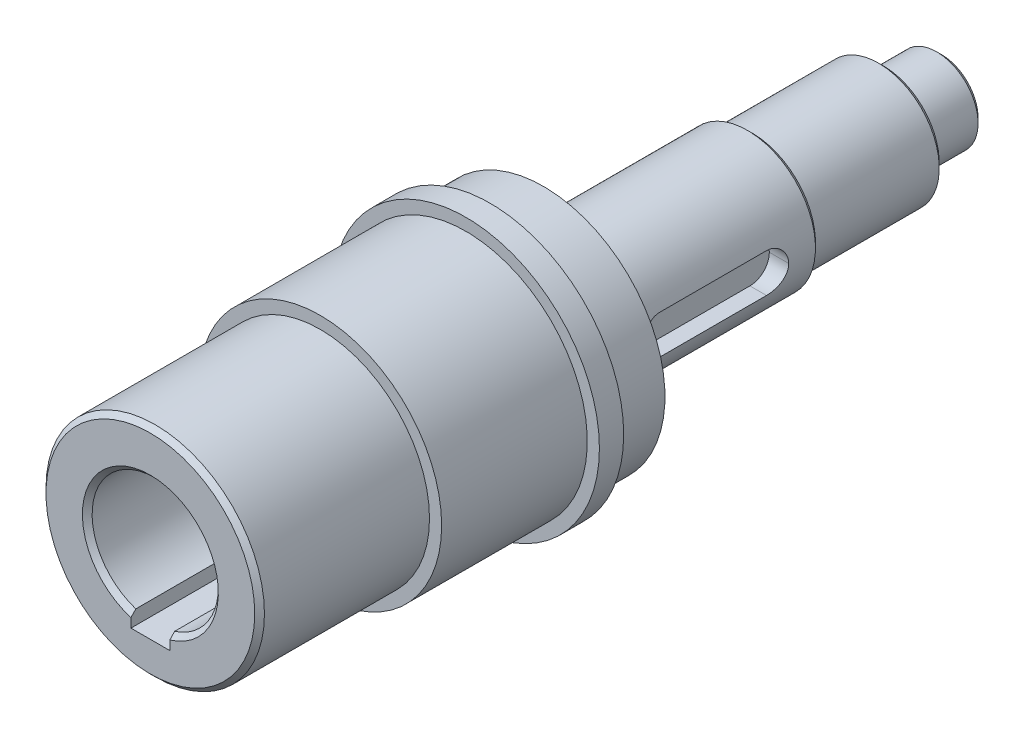
ISO-10303-21;
HEADER;
FILE_DESCRIPTION(('STEP AP214'),'2;1');
FILE_NAME('part.step','',(''),(''),'','','');
FILE_SCHEMA(('AUTOMOTIVE_DESIGN { 1 0 10303 214 1 1 1 1 }'));
ENDSEC;
DATA;
#1=APPLICATION_CONTEXT('core data for automotive mechanical design processes');
#2=APPLICATION_PROTOCOL_DEFINITION('international standard','automotive_design',2000,#1);
#3=PRODUCT_CONTEXT('',#1,'mechanical');
#4=PRODUCT('Part','Part','',(#3));
#5=PRODUCT_RELATED_PRODUCT_CATEGORY('part','',(#4));
#6=PRODUCT_DEFINITION_FORMATION('','',#4);
#7=PRODUCT_DEFINITION_CONTEXT('part definition',#1,'design');
#8=PRODUCT_DEFINITION('design','',#6,#7);
#9=PRODUCT_DEFINITION_SHAPE('','',#8);
#10=(LENGTH_UNIT() NAMED_UNIT(*) SI_UNIT(.MILLI.,.METRE.));
#11=(NAMED_UNIT(*) PLANE_ANGLE_UNIT() SI_UNIT($,.RADIAN.));
#12=(NAMED_UNIT(*) SI_UNIT($,.STERADIAN.) SOLID_ANGLE_UNIT());
#13=UNCERTAINTY_MEASURE_WITH_UNIT(LENGTH_MEASURE(1.E-05),#10,'distance_accuracy_value','');
#14=(GEOMETRIC_REPRESENTATION_CONTEXT(3) GLOBAL_UNCERTAINTY_ASSIGNED_CONTEXT((#13)) GLOBAL_UNIT_ASSIGNED_CONTEXT((#10,
#11,#12)) REPRESENTATION_CONTEXT('',''));
#15=CARTESIAN_POINT('',(0.,0.,0.));
#16=DIRECTION('',(0.,0.,1.));
#17=DIRECTION('',(1.,0.,0.));
#18=AXIS2_PLACEMENT_3D('',#15,#16,#17);
#19=CARTESIAN_POINT('',(0.,0.,30.));
#20=DIRECTION('',(0.,0.,1.));
#21=DIRECTION('',(1.,0.,0.));
#22=AXIS2_PLACEMENT_3D('',#19,#20,#21);
#23=PLANE('',#22);
#24=CARTESIAN_POINT('',(0.,0.,30.));
#25=DIRECTION('',(0.,0.,1.));
#26=DIRECTION('',(1.,0.,0.));
#27=AXIS2_PLACEMENT_3D('',#24,#25,#26);
#28=CIRCLE('',#27,25.);
#29=CARTESIAN_POINT('',(25.,0.,30.));
#30=VERTEX_POINT('',#29);
#31=EDGE_CURVE('E188',#30,#30,#28,.T.);
#32=ORIENTED_EDGE('',*,*,#31,.T.);
#33=EDGE_LOOP('',(#32));
#34=FACE_BOUND('',#33,.T.);
#35=CARTESIAN_POINT('',(0.,0.,30.));
#36=DIRECTION('',(0.,0.,1.));
#37=DIRECTION('',(1.,0.,0.));
#38=AXIS2_PLACEMENT_3D('',#35,#36,#37);
#39=CIRCLE('',#38,22.5);
#40=CARTESIAN_POINT('',(22.5,0.,30.));
#41=VERTEX_POINT('',#40);
#42=EDGE_CURVE('E153',#41,#41,#39,.T.);
#43=ORIENTED_EDGE('',*,*,#42,.F.);
#44=EDGE_LOOP('',(#43));
#45=FACE_BOUND('',#44,.T.);
#46=ADVANCED_FACE('F32',(#34,#45),#23,.T.);
#47=CARTESIAN_POINT('',(0.,0.,-59.));
#48=DIRECTION('',(0.,0.,1.));
#49=DIRECTION('',(1.,0.,0.));
#50=AXIS2_PLACEMENT_3D('',#47,#48,#49);
#51=CYLINDRICAL_SURFACE('',#50,14.);
#52=CARTESIAN_POINT('',(0.,0.,-58.));
#53=DIRECTION('',(0.,0.,-1.));
#54=DIRECTION('',(-1.,0.,0.));
#55=AXIS2_PLACEMENT_3D('',#52,#53,#54);
#56=CIRCLE('',#55,14.);
#57=CARTESIAN_POINT('',(-14.,0.,-58.));
#58=VERTEX_POINT('',#57);
#59=EDGE_CURVE('E286',#58,#58,#56,.F.);
#60=ORIENTED_EDGE('',*,*,#59,.T.);
#61=EDGE_LOOP('',(#60));
#62=FACE_BOUND('',#61,.T.);
#63=CARTESIAN_POINT('',(0.,0.,-16.));
#64=DIRECTION('',(0.,0.,-1.));
#65=DIRECTION('',(-1.,0.,0.));
#66=AXIS2_PLACEMENT_3D('',#63,#64,#65);
#67=CIRCLE('',#66,14.);
#68=CARTESIAN_POINT('',(-14.,0.,-16.));
#69=VERTEX_POINT('',#68);
#70=EDGE_CURVE('E170',#69,#69,#67,.T.);
#71=ORIENTED_EDGE('',*,*,#70,.T.);
#72=EDGE_LOOP('',(#71));
#73=FACE_BOUND('',#72,.T.);
#74=DIRECTION('',(0.,0.,1.));
#75=VECTOR('',#74,1.);
#76=CARTESIAN_POINT('',(13.4164078649987,4.,-59.));
#77=LINE('',#76,#75);
#78=CARTESIAN_POINT('',(13.4164078649987,4.,-48.5));
#79=VERTEX_POINT('',#78);
#80=CARTESIAN_POINT('',(13.4164078649987,4.,-26.5));
#81=VERTEX_POINT('',#80);
#82=EDGE_CURVE('E194',#79,#81,#77,.T.);
#83=ORIENTED_EDGE('',*,*,#82,.F.);
#84=CARTESIAN_POINT('',(13.4164078649987,4.,-48.5));
#85=CARTESIAN_POINT('',(13.4163934321272,4.0000134374781,-48.6100406554383));
#86=CARTESIAN_POINT('',(13.4177613570236,3.99545938644264,-48.7200728968872));
#87=CARTESIAN_POINT('',(13.4231547279479,3.97732079000552,-48.9393027699563));
#88=CARTESIAN_POINT('',(13.427179622583,3.96373811828131,-49.0485005699901));
#89=CARTESIAN_POINT('',(13.4377669502034,3.92769050614894,-49.2650268661266));
#90=CARTESIAN_POINT('',(13.4443231971897,3.90524721590965,-49.3723592577489));
#91=CARTESIAN_POINT('',(13.4597628592722,3.85169506016458,-49.5846401102622));
#92=CARTESIAN_POINT('',(13.4686463261376,3.82058600188661,-49.6895885180648));
#93=CARTESIAN_POINT('',(13.4984068881322,3.71462838325496,-49.9997142943038));
#94=CARTESIAN_POINT('',(13.5224074804698,3.62710670956421,-50.2004258811946));
#95=CARTESIAN_POINT('',(13.5760100500548,3.42099709777644,-50.5843109404557));
#96=CARTESIAN_POINT('',(13.6056144792319,3.30239555207701,-50.7674766826981));
#97=CARTESIAN_POINT('',(13.6680341442193,3.03385736341642,-51.1163669547689));
#98=CARTESIAN_POINT('',(13.7009124675883,2.88319190015281,-51.2815203031068));
#99=CARTESIAN_POINT('',(13.7656370459004,2.55635384206476,-51.5845978446865));
#100=CARTESIAN_POINT('',(13.7974831007095,2.38017633679533,-51.722516783863));
#101=CARTESIAN_POINT('',(13.8572760629292,2.00323634464421,-51.9696959203528));
#102=CARTESIAN_POINT('',(13.8851379798946,1.80207241215168,-52.0783657269484));
#103=CARTESIAN_POINT('',(13.9330649446853,1.38345521230697,-52.2600546678482));
#104=CARTESIAN_POINT('',(13.9531365167592,1.16601575821841,-52.3331036470415));
#105=CARTESIAN_POINT('',(13.9785714355868,0.789575858579064,-52.4245085952495));
#106=CARTESIAN_POINT('',(13.9865571355139,0.633085965451191,-52.4527649710638));
#107=CARTESIAN_POINT('',(13.9972933950756,0.317760614673371,-52.4905272126967));
#108=CARTESIAN_POINT('',(14.0000463743578,0.158926275370485,-52.5000417449528));
#109=CARTESIAN_POINT('',(14.,0.,-52.5));
#110=B_SPLINE_CURVE_WITH_KNOTS('',3,(#84,#85,#86,#87,#88,#89,#90,#91,#92,#93,#94,#95,#96,#97,
#98,#99,#100,#101,#102,#103,#104,#105,#106,#107,#108,#109),.UNSPECIFIED.,.F.,.F.,(4,2,2,2,2,2,2,
2,2,2,2,2,4),(0.,0.33000488984895,0.659941316332416,0.989076511597483,1.31821902914261,
1.97574105328547,2.63355144060491,3.30831561740276,3.98320984287859,4.67084909752221,
5.35791121984491,5.83443142768569,6.31073123549609),.UNSPECIFIED.);
#111=CARTESIAN_POINT('',(14.,0.,-52.5));
#112=VERTEX_POINT('',#111);
#113=EDGE_CURVE('E56',#79,#112,#110,.T.);
#114=ORIENTED_EDGE('',*,*,#113,.T.);
#115=CARTESIAN_POINT('',(14.,0.,-52.5));
#116=CARTESIAN_POINT('',(14.0000122879939,-0.110133457837792,-52.5000132190537));
#117=CARTESIAN_POINT('',(13.9987007062499,-0.220259025566227,-52.4954517034426));
#118=CARTESIAN_POINT('',(13.9935210588999,-0.43968088440434,-52.4772817880092));
#119=CARTESIAN_POINT('',(13.9896534680637,-0.548977325708555,-52.463675068299));
#120=CARTESIAN_POINT('',(13.979464712363,-0.765719670965622,-52.4275587934898));
#121=CARTESIAN_POINT('',(13.9731492046936,-0.87316924943883,-52.405069763366));
#122=CARTESIAN_POINT('',(13.9582468488763,-1.0856861560804,-52.3514040166993));
#123=CARTESIAN_POINT('',(13.949659962391,-1.19075344400663,-52.3202271535179));
#124=CARTESIAN_POINT('',(13.9208208089066,-1.50125367832883,-52.2140236966482));
#125=CARTESIAN_POINT('',(13.8974784095358,-1.70221721606197,-52.1262851501577));
#126=CARTESIAN_POINT('',(13.8450062796287,-2.08652180730309,-51.9196680633515));
#127=CARTESIAN_POINT('',(13.8158743810639,-2.26985622084845,-51.8007778521582));
#128=CARTESIAN_POINT('',(13.7540965552476,-2.61857086876639,-51.5319391982042));
#129=CARTESIAN_POINT('',(13.7213841929149,-2.78342863308855,-51.3813272149399));
#130=CARTESIAN_POINT('',(13.6565376659012,-3.08593204931604,-51.054719619717));
#131=CARTESIAN_POINT('',(13.6244036460001,-3.22357097118191,-50.8787177484986));
#132=CARTESIAN_POINT('',(13.5636500942346,-3.47043697755911,-50.5019532189197));
#133=CARTESIAN_POINT('',(13.535115610036,-3.5790273273352,-50.3007587611637));
#134=CARTESIAN_POINT('',(13.4858113503487,-3.76055754481758,-49.8820849449694));
#135=CARTESIAN_POINT('',(13.4650346016179,-3.83352944731136,-49.6646204234283));
#136=CARTESIAN_POINT('',(13.4386748953873,-3.924736283725,-49.2883879032344));
#137=CARTESIAN_POINT('',(13.430383956879,-3.95290477030514,-49.1321477240518));
#138=CARTESIAN_POINT('',(13.4192241683275,-3.9905544086291,-48.8173027587836));
#139=CARTESIAN_POINT('',(13.4163533652254,-4.0000422916816,-48.6586988452031));
#140=CARTESIAN_POINT('',(13.4164078649987,-4.,-48.5));
#141=B_SPLINE_CURVE_WITH_KNOTS('',3,(#115,#116,#117,#118,#119,#120,#121,#122,#123,#124,#125,
#126,#127,#128,#129,#130,#131,#132,#133,#134,#135,#136,#137,#138,#139,#140),.UNSPECIFIED.,.F.,
.F.,(4,2,2,2,2,2,2,2,2,2,2,2,4),(0.,0.330284589448135,0.660507846935757,0.989972457453345,
1.31944262921197,1.97768454748984,2.63617342761382,3.31011945579538,3.98423191382647,
4.6720933624685,5.35933501191985,5.83511832365931,6.31073016176927),.UNSPECIFIED.);
#142=CARTESIAN_POINT('',(13.4164078649987,-4.,-48.5));
#143=VERTEX_POINT('',#142);
#144=EDGE_CURVE('E256',#112,#143,#141,.T.);
#145=ORIENTED_EDGE('',*,*,#144,.T.);
#146=DIRECTION('',(0.,0.,1.));
#147=VECTOR('',#146,1.);
#148=CARTESIAN_POINT('',(13.4164078649987,-4.,-59.));
#149=LINE('',#148,#147);
#150=CARTESIAN_POINT('',(13.4164078649987,-4.,-26.5));
#151=VERTEX_POINT('',#150);
#152=EDGE_CURVE('E191',#143,#151,#149,.T.);
#153=ORIENTED_EDGE('',*,*,#152,.T.);
#154=CARTESIAN_POINT('',(13.4164078649987,-4.,-26.5));
#155=CARTESIAN_POINT('',(13.4163934321272,-4.0000134374781,-26.3899593445617));
#156=CARTESIAN_POINT('',(13.4177613570237,-3.99545938644264,-26.2799271031128));
#157=CARTESIAN_POINT('',(13.4231547279479,-3.97732079000552,-26.0606972300437));
#158=CARTESIAN_POINT('',(13.427179622583,-3.96373811828131,-25.9514994300099));
#159=CARTESIAN_POINT('',(13.4377669502034,-3.92769050614894,-25.7349731338734));
#160=CARTESIAN_POINT('',(13.4443231971897,-3.90524721590965,-25.6276407422511));
#161=CARTESIAN_POINT('',(13.4597628592722,-3.85169506016458,-25.4153598897378));
#162=CARTESIAN_POINT('',(13.4686463261376,-3.82058600188661,-25.3104114819353));
#163=CARTESIAN_POINT('',(13.4984068881322,-3.71462838325496,-25.0002857056962));
#164=CARTESIAN_POINT('',(13.5224074804698,-3.62710670956421,-24.7995741188054));
#165=CARTESIAN_POINT('',(13.5760100500548,-3.42099709777644,-24.4156890595443));
#166=CARTESIAN_POINT('',(13.6056144792319,-3.30239555207701,-24.2325233173019));
#167=CARTESIAN_POINT('',(13.6680341442193,-3.03385736341641,-23.8836330452311));
#168=CARTESIAN_POINT('',(13.7009124675883,-2.8831919001528,-23.7184796968932));
#169=CARTESIAN_POINT('',(13.7656370459004,-2.55635384206476,-23.4154021553135));
#170=CARTESIAN_POINT('',(13.7974831007095,-2.38017633679532,-23.277483216137));
#171=CARTESIAN_POINT('',(13.8572760629292,-2.00323634464421,-23.0303040796472));
#172=CARTESIAN_POINT('',(13.8851379798946,-1.80207241215168,-22.9216342730516));
#173=CARTESIAN_POINT('',(13.9330649446853,-1.38345521230697,-22.7399453321518));
#174=CARTESIAN_POINT('',(13.9531365167592,-1.16601575821841,-22.6668963529585));
#175=CARTESIAN_POINT('',(13.9785714355868,-0.789575858579068,-22.5754914047505));
#176=CARTESIAN_POINT('',(13.9865571355139,-0.633085965451194,-22.5472350289362));
#177=CARTESIAN_POINT('',(13.9972933950756,-0.317760614673372,-22.5094727873033));
#178=CARTESIAN_POINT('',(14.0000463743578,-0.158926275370486,-22.4999582550472));
#179=CARTESIAN_POINT('',(14.,0.,-22.5));
#180=B_SPLINE_CURVE_WITH_KNOTS('',3,(#154,#155,#156,#157,#158,#159,#160,#161,#162,#163,#164,
#165,#166,#167,#168,#169,#170,#171,#172,#173,#174,#175,#176,#177,#178,#179),.UNSPECIFIED.,.F.,
.F.,(4,2,2,2,2,2,2,2,2,2,2,2,4),(0.,0.33000488984895,0.659941316332419,0.98907651159748,
1.31821902914261,1.97574105328547,2.63355144060492,3.30831561740276,3.9832098428786,
4.67084909752221,5.35791121984491,5.83443142768569,6.31073123549609),.UNSPECIFIED.);
#181=CARTESIAN_POINT('',(14.,0.,-22.5));
#182=VERTEX_POINT('',#181);
#183=EDGE_CURVE('E223',#151,#182,#180,.T.);
#184=ORIENTED_EDGE('',*,*,#183,.T.);
#185=CARTESIAN_POINT('',(14.,0.,-22.5));
#186=CARTESIAN_POINT('',(14.0000122879939,0.110133457837793,-22.4999867809463));
#187=CARTESIAN_POINT('',(13.9987007062499,0.220259025566229,-22.5045482965574));
#188=CARTESIAN_POINT('',(13.9935210588999,0.439680884404341,-22.5227182119908));
#189=CARTESIAN_POINT('',(13.9896534680637,0.548977325708556,-22.536324931701));
#190=CARTESIAN_POINT('',(13.979464712363,0.765719670965623,-22.5724412065103));
#191=CARTESIAN_POINT('',(13.9731492046936,0.873169249438832,-22.594930236634));
#192=CARTESIAN_POINT('',(13.9582468488763,1.0856861560804,-22.6485959833007));
#193=CARTESIAN_POINT('',(13.949659962391,1.19075344400664,-22.6797728464821));
#194=CARTESIAN_POINT('',(13.9208208089066,1.50125367832883,-22.7859763033518));
#195=CARTESIAN_POINT('',(13.8974784095358,1.70221721606197,-22.8737148498423));
#196=CARTESIAN_POINT('',(13.8450062796287,2.0865218073031,-23.0803319366485));
#197=CARTESIAN_POINT('',(13.8158743810639,2.26985622084846,-23.1992221478418));
#198=CARTESIAN_POINT('',(13.7540965552476,2.6185708687664,-23.4680608017958));
#199=CARTESIAN_POINT('',(13.7213841929149,2.78342863308855,-23.6186727850601));
#200=CARTESIAN_POINT('',(13.6565376659012,3.08593204931604,-23.945280380283));
#201=CARTESIAN_POINT('',(13.6244036460001,3.22357097118191,-24.1212822515014));
#202=CARTESIAN_POINT('',(13.5636500942346,3.47043697755912,-24.4980467810803));
#203=CARTESIAN_POINT('',(13.535115610036,3.5790273273352,-24.6992412388363));
#204=CARTESIAN_POINT('',(13.4858113503487,3.76055754481759,-25.1179150550306));
#205=CARTESIAN_POINT('',(13.4650346016179,3.83352944731136,-25.3353795765717));
#206=CARTESIAN_POINT('',(13.4386748953873,3.924736283725,-25.7116120967657));
#207=CARTESIAN_POINT('',(13.430383956879,3.95290477030514,-25.8678522759482));
#208=CARTESIAN_POINT('',(13.4192241683275,3.99055440862911,-26.1826972412164));
#209=CARTESIAN_POINT('',(13.4163533652254,4.0000422916816,-26.3413011547969));
#210=CARTESIAN_POINT('',(13.4164078649987,4.,-26.5));
#211=B_SPLINE_CURVE_WITH_KNOTS('',3,(#185,#186,#187,#188,#189,#190,#191,#192,#193,#194,#195,
#196,#197,#198,#199,#200,#201,#202,#203,#204,#205,#206,#207,#208,#209,#210),.UNSPECIFIED.,.F.,
.F.,(4,2,2,2,2,2,2,2,2,2,2,2,4),(0.,0.330284589448136,0.660507846935759,0.989972457453348,
1.31944262921198,1.97768454748985,2.63617342761382,3.31011945579538,3.98423191382648,
4.67209336246851,5.35933501191986,5.83511832365932,6.31073016176927),.UNSPECIFIED.);
#212=EDGE_CURVE('E215',#182,#81,#211,.T.);
#213=ORIENTED_EDGE('',*,*,#212,.T.);
#214=EDGE_LOOP('',(#83,#114,#145,#153,#184,#213));
#215=FACE_BOUND('',#214,.T.);
#216=ADVANCED_FACE('F230',(#62,#73,#215),#51,.T.);
#217=CARTESIAN_POINT('',(0.,0.,-86.));
#218=DIRECTION('',(0.,0.,-1.));
#219=DIRECTION('',(-1.,0.,0.));
#220=AXIS2_PLACEMENT_3D('',#217,#218,#219);
#221=PLANE('',#220);
#222=CARTESIAN_POINT('',(0.,0.,-86.));
#223=DIRECTION('',(0.,0.,-1.));
#224=DIRECTION('',(-1.,0.,0.));
#225=AXIS2_PLACEMENT_3D('',#222,#223,#224);
#226=CIRCLE('',#225,11.5);
#227=CARTESIAN_POINT('',(-11.5,0.,-86.));
#228=VERTEX_POINT('',#227);
#229=EDGE_CURVE('E277',#228,#228,#226,.T.);
#230=ORIENTED_EDGE('',*,*,#229,.T.);
#231=EDGE_LOOP('',(#230));
#232=FACE_BOUND('',#231,.T.);
#233=CARTESIAN_POINT('',(0.,0.,-86.));
#234=DIRECTION('',(0.,0.,-1.));
#235=DIRECTION('',(-1.,0.,0.));
#236=AXIS2_PLACEMENT_3D('',#233,#234,#235);
#237=CIRCLE('',#236,8.5);
#238=CARTESIAN_POINT('',(-8.5,0.,-86.));
#239=VERTEX_POINT('',#238);
#240=EDGE_CURVE('E164',#239,#239,#237,.T.);
#241=ORIENTED_EDGE('',*,*,#240,.F.);
#242=EDGE_LOOP('',(#241));
#243=FACE_BOUND('',#242,.T.);
#244=ADVANCED_FACE('F355',(#232,#243),#221,.T.);
#245=CARTESIAN_POINT('',(0.,0.,-59.));
#246=DIRECTION('',(0.,0.,-1.));
#247=DIRECTION('',(-1.,0.,0.));
#248=AXIS2_PLACEMENT_3D('',#245,#246,#247);
#249=PLANE('',#248);
#250=CARTESIAN_POINT('',(0.,0.,-59.));
#251=DIRECTION('',(0.,0.,-1.));
#252=DIRECTION('',(-1.,0.,0.));
#253=AXIS2_PLACEMENT_3D('',#250,#251,#252);
#254=CIRCLE('',#253,13.);
#255=CARTESIAN_POINT('',(-13.,0.,-59.));
#256=VERTEX_POINT('',#255);
#257=EDGE_CURVE('E283',#256,#256,#254,.T.);
#258=ORIENTED_EDGE('',*,*,#257,.T.);
#259=EDGE_LOOP('',(#258));
#260=FACE_BOUND('',#259,.T.);
#261=CARTESIAN_POINT('',(0.,0.,-59.));
#262=DIRECTION('',(0.,0.,-1.));
#263=DIRECTION('',(-1.,0.,0.));
#264=AXIS2_PLACEMENT_3D('',#261,#262,#263);
#265=CIRCLE('',#264,12.5);
#266=CARTESIAN_POINT('',(-12.5,0.,-59.));
#267=VERTEX_POINT('',#266);
#268=EDGE_CURVE('E167',#267,#267,#265,.T.);
#269=ORIENTED_EDGE('',*,*,#268,.F.);
#270=EDGE_LOOP('',(#269));
#271=FACE_BOUND('',#270,.T.);
#272=ADVANCED_FACE('F358',(#260,#271),#249,.T.);
#273=CARTESIAN_POINT('',(0.,0.,-16.));
#274=DIRECTION('',(0.,0.,-1.));
#275=DIRECTION('',(-1.,0.,0.));
#276=AXIS2_PLACEMENT_3D('',#273,#274,#275);
#277=PLANE('',#276);
#278=CARTESIAN_POINT('',(0.,0.,-16.));
#279=DIRECTION('',(0.,0.,-1.));
#280=DIRECTION('',(-1.,0.,0.));
#281=AXIS2_PLACEMENT_3D('',#278,#279,#280);
#282=CIRCLE('',#281,25.);
#283=CARTESIAN_POINT('',(-25.,0.,-16.));
#284=VERTEX_POINT('',#283);
#285=EDGE_CURVE('E174',#284,#284,#282,.T.);
#286=ORIENTED_EDGE('',*,*,#285,.T.);
#287=EDGE_LOOP('',(#286));
#288=FACE_BOUND('',#287,.T.);
#289=ORIENTED_EDGE('',*,*,#70,.F.);
#290=EDGE_LOOP('',(#289));
#291=FACE_BOUND('',#290,.T.);
#292=ADVANCED_FACE('F364',(#288,#291),#277,.T.);
#293=CARTESIAN_POINT('',(0.,0.,-5.));
#294=DIRECTION('',(0.,0.,-1.));
#295=DIRECTION('',(-1.,0.,0.));
#296=AXIS2_PLACEMENT_3D('',#293,#294,#295);
#297=PLANE('',#296);
#298=CARTESIAN_POINT('',(0.,0.,-5.));
#299=DIRECTION('',(0.,0.,-1.));
#300=DIRECTION('',(-1.,0.,0.));
#301=AXIS2_PLACEMENT_3D('',#298,#299,#300);
#302=CIRCLE('',#301,27.5);
#303=CARTESIAN_POINT('',(-27.5,0.,-5.));
#304=VERTEX_POINT('',#303);
#305=EDGE_CURVE('E180',#304,#304,#302,.T.);
#306=ORIENTED_EDGE('',*,*,#305,.T.);
#307=EDGE_LOOP('',(#306));
#308=FACE_BOUND('',#307,.T.);
#309=CARTESIAN_POINT('',(0.,0.,-5.));
#310=DIRECTION('',(0.,0.,-1.));
#311=DIRECTION('',(-1.,0.,0.));
#312=AXIS2_PLACEMENT_3D('',#309,#310,#311);
#313=CIRCLE('',#312,25.);
#314=CARTESIAN_POINT('',(-25.,0.,-5.));
#315=VERTEX_POINT('',#314);
#316=EDGE_CURVE('E173',#315,#315,#313,.T.);
#317=ORIENTED_EDGE('',*,*,#316,.F.);
#318=EDGE_LOOP('',(#317));
#319=FACE_BOUND('',#318,.T.);
#320=ADVANCED_FACE('F369',(#308,#319),#297,.T.);
#321=CARTESIAN_POINT('',(0.,0.,30.));
#322=DIRECTION('',(0.,0.,-1.));
#323=DIRECTION('',(-1.,0.,0.));
#324=AXIS2_PLACEMENT_3D('',#321,#322,#323);
#325=CYLINDRICAL_SURFACE('',#324,25.);
#326=ORIENTED_EDGE('',*,*,#31,.F.);
#327=EDGE_LOOP('',(#326));
#328=FACE_BOUND('',#327,.T.);
#329=CARTESIAN_POINT('',(0.,0.,0.));
#330=DIRECTION('',(0.,0.,-1.));
#331=DIRECTION('',(-1.,0.,0.));
#332=AXIS2_PLACEMENT_3D('',#329,#330,#331);
#333=CIRCLE('',#332,25.);
#334=CARTESIAN_POINT('',(-25.,0.,0.));
#335=VERTEX_POINT('',#334);
#336=EDGE_CURVE('E183',#335,#335,#333,.T.);
#337=ORIENTED_EDGE('',*,*,#336,.F.);
#338=EDGE_LOOP('',(#337));
#339=FACE_BOUND('',#338,.T.);
#340=ADVANCED_FACE('F241',(#328,#339),#325,.T.);
#341=CARTESIAN_POINT('',(0.,0.,0.));
#342=DIRECTION('',(0.,0.,-1.));
#343=DIRECTION('',(-1.,0.,0.));
#344=AXIS2_PLACEMENT_3D('',#341,#342,#343);
#345=PLANE('',#344);
#346=CARTESIAN_POINT('',(0.,0.,0.));
#347=DIRECTION('',(0.,0.,-1.));
#348=DIRECTION('',(-1.,0.,0.));
#349=AXIS2_PLACEMENT_3D('',#346,#347,#348);
#350=CIRCLE('',#349,27.5);
#351=CARTESIAN_POINT('',(-27.5,0.,0.));
#352=VERTEX_POINT('',#351);
#353=EDGE_CURVE('E177',#352,#352,#350,.T.);
#354=ORIENTED_EDGE('',*,*,#353,.F.);
#355=EDGE_LOOP('',(#354));
#356=FACE_BOUND('',#355,.T.);
#357=ORIENTED_EDGE('',*,*,#336,.T.);
#358=EDGE_LOOP('',(#357));
#359=FACE_BOUND('',#358,.T.);
#360=ADVANCED_FACE('F383',(#356,#359),#345,.F.);
#361=CARTESIAN_POINT('',(0.,0.,-5.));
#362=DIRECTION('',(0.,0.,1.));
#363=DIRECTION('',(1.,0.,0.));
#364=AXIS2_PLACEMENT_3D('',#361,#362,#363);
#365=CYLINDRICAL_SURFACE('',#364,27.5);
#366=ORIENTED_EDGE('',*,*,#305,.F.);
#367=EDGE_LOOP('',(#366));
#368=FACE_BOUND('',#367,.T.);
#369=ORIENTED_EDGE('',*,*,#353,.T.);
#370=EDGE_LOOP('',(#369));
#371=FACE_BOUND('',#370,.T.);
#372=ADVANCED_FACE('F380',(#368,#371),#365,.T.);
#373=CARTESIAN_POINT('',(0.,0.,-16.));
#374=DIRECTION('',(0.,0.,1.));
#375=DIRECTION('',(1.,0.,0.));
#376=AXIS2_PLACEMENT_3D('',#373,#374,#375);
#377=CYLINDRICAL_SURFACE('',#376,25.);
#378=ORIENTED_EDGE('',*,*,#285,.F.);
#379=EDGE_LOOP('',(#378));
#380=FACE_BOUND('',#379,.T.);
#381=ORIENTED_EDGE('',*,*,#316,.T.);
#382=EDGE_LOOP('',(#381));
#383=FACE_BOUND('',#382,.T.);
#384=ADVANCED_FACE('F361',(#380,#383),#377,.T.);
#385=CARTESIAN_POINT('',(0.,0.,-86.));
#386=DIRECTION('',(0.,0.,1.));
#387=DIRECTION('',(1.,0.,0.));
#388=AXIS2_PLACEMENT_3D('',#385,#386,#387);
#389=CYLINDRICAL_SURFACE('',#388,12.5);
#390=CARTESIAN_POINT('',(0.,0.,-85.));
#391=DIRECTION('',(0.,0.,-1.));
#392=DIRECTION('',(-1.,0.,0.));
#393=AXIS2_PLACEMENT_3D('',#390,#391,#392);
#394=CIRCLE('',#393,12.5);
#395=CARTESIAN_POINT('',(-12.5,0.,-85.));
#396=VERTEX_POINT('',#395);
#397=EDGE_CURVE('E280',#396,#396,#394,.F.);
#398=ORIENTED_EDGE('',*,*,#397,.T.);
#399=EDGE_LOOP('',(#398));
#400=FACE_BOUND('',#399,.T.);
#401=ORIENTED_EDGE('',*,*,#268,.T.);
#402=EDGE_LOOP('',(#401));
#403=FACE_BOUND('',#402,.T.);
#404=ADVANCED_FACE('F353',(#400,#403),#389,.T.);
#405=CARTESIAN_POINT('',(0.,0.,-98.));
#406=DIRECTION('',(0.,0.,1.));
#407=DIRECTION('',(1.,0.,0.));
#408=AXIS2_PLACEMENT_3D('',#405,#406,#407);
#409=CYLINDRICAL_SURFACE('',#408,8.5);
#410=CARTESIAN_POINT('',(0.,0.,-96.9999999999999));
#411=DIRECTION('',(0.,0.,-1.));
#412=DIRECTION('',(-1.,0.,0.));
#413=AXIS2_PLACEMENT_3D('',#410,#411,#412);
#414=CIRCLE('',#413,8.5);
#415=CARTESIAN_POINT('',(-8.5,0.,-96.9999999999999));
#416=VERTEX_POINT('',#415);
#417=EDGE_CURVE('E274',#416,#416,#414,.F.);
#418=ORIENTED_EDGE('',*,*,#417,.T.);
#419=EDGE_LOOP('',(#418));
#420=FACE_BOUND('',#419,.T.);
#421=ORIENTED_EDGE('',*,*,#240,.T.);
#422=EDGE_LOOP('',(#421));
#423=FACE_BOUND('',#422,.T.);
#424=ADVANCED_FACE('F349',(#420,#423),#409,.T.);
#425=CARTESIAN_POINT('',(0.,0.,-98.));
#426=DIRECTION('',(0.,0.,-1.));
#427=DIRECTION('',(-1.,0.,0.));
#428=AXIS2_PLACEMENT_3D('',#425,#426,#427);
#429=PLANE('',#428);
#430=CARTESIAN_POINT('',(0.,0.,-98.));
#431=DIRECTION('',(0.,0.,-1.));
#432=DIRECTION('',(-1.,0.,0.));
#433=AXIS2_PLACEMENT_3D('',#430,#431,#432);
#434=CIRCLE('',#433,7.49999999999997);
#435=CARTESIAN_POINT('',(-7.49999999999997,0.,-98.));
#436=VERTEX_POINT('',#435);
#437=EDGE_CURVE('E267',#436,#436,#434,.T.);
#438=ORIENTED_EDGE('',*,*,#437,.T.);
#439=EDGE_LOOP('',(#438));
#440=FACE_BOUND('',#439,.T.);
#441=ADVANCED_FACE('F342',(#440),#429,.T.);
#442=CARTESIAN_POINT('',(14.,4.,-22.5));
#443=DIRECTION('',(0.,-1.,0.));
#444=DIRECTION('',(0.,0.,-1.));
#445=AXIS2_PLACEMENT_3D('',#442,#443,#444);
#446=PLANE('',#445);
#447=ORIENTED_EDGE('',*,*,#82,.T.);
#448=DIRECTION('',(1.,0.,0.));
#449=VECTOR('',#448,1.);
#450=CARTESIAN_POINT('',(10.,4.,-26.5));
#451=LINE('',#450,#449);
#452=CARTESIAN_POINT('',(10.,4.,-26.5));
#453=VERTEX_POINT('',#452);
#454=EDGE_CURVE('E199',#81,#453,#451,.F.);
#455=ORIENTED_EDGE('',*,*,#454,.T.);
#456=DIRECTION('',(0.,0.,1.));
#457=VECTOR('',#456,1.);
#458=CARTESIAN_POINT('',(10.,4.,-52.5));
#459=LINE('',#458,#457);
#460=CARTESIAN_POINT('',(10.,4.,-48.5));
#461=VERTEX_POINT('',#460);
#462=EDGE_CURVE('E160',#461,#453,#459,.T.);
#463=ORIENTED_EDGE('',*,*,#462,.F.);
#464=DIRECTION('',(-1.,0.,0.));
#465=VECTOR('',#464,1.);
#466=CARTESIAN_POINT('',(13.4164078649987,4.,-48.5));
#467=LINE('',#466,#465);
#468=EDGE_CURVE('E197',#461,#79,#467,.F.);
#469=ORIENTED_EDGE('',*,*,#468,.T.);
#470=EDGE_LOOP('',(#447,#455,#463,#469));
#471=FACE_BOUND('',#470,.T.);
#472=ADVANCED_FACE('F338',(#471),#446,.T.);
#473=CARTESIAN_POINT('',(14.,-4.,-22.5));
#474=DIRECTION('',(0.,-1.,0.));
#475=DIRECTION('',(0.,0.,-1.));
#476=AXIS2_PLACEMENT_3D('',#473,#474,#475);
#477=PLANE('',#476);
#478=DIRECTION('',(0.,0.,1.));
#479=VECTOR('',#478,1.);
#480=CARTESIAN_POINT('',(10.,-4.,-52.5));
#481=LINE('',#480,#479);
#482=CARTESIAN_POINT('',(10.,-4.,-48.5));
#483=VERTEX_POINT('',#482);
#484=CARTESIAN_POINT('',(10.,-4.,-26.5));
#485=VERTEX_POINT('',#484);
#486=EDGE_CURVE('E157',#483,#485,#481,.T.);
#487=ORIENTED_EDGE('',*,*,#486,.T.);
#488=DIRECTION('',(1.,0.,0.));
#489=VECTOR('',#488,1.);
#490=CARTESIAN_POINT('',(14.,-4.,-26.5));
#491=LINE('',#490,#489);
#492=EDGE_CURVE('E213',#485,#151,#491,.T.);
#493=ORIENTED_EDGE('',*,*,#492,.T.);
#494=ORIENTED_EDGE('',*,*,#152,.F.);
#495=DIRECTION('',(-1.,0.,0.));
#496=VECTOR('',#495,1.);
#497=CARTESIAN_POINT('',(14.,-4.,-48.5));
#498=LINE('',#497,#496);
#499=EDGE_CURVE('E210',#143,#483,#498,.T.);
#500=ORIENTED_EDGE('',*,*,#499,.T.);
#501=EDGE_LOOP('',(#487,#493,#494,#500));
#502=FACE_BOUND('',#501,.T.);
#503=ADVANCED_FACE('F335',(#502),#477,.F.);
#504=CARTESIAN_POINT('',(10.,4.,-52.5));
#505=DIRECTION('',(1.,0.,0.));
#506=DIRECTION('',(0.,0.,-1.));
#507=AXIS2_PLACEMENT_3D('',#504,#505,#506);
#508=PLANE('',#507);
#509=ORIENTED_EDGE('',*,*,#462,.T.);
#510=CARTESIAN_POINT('',(10.,0.,-26.5));
#511=DIRECTION('',(1.,0.,0.));
#512=DIRECTION('',(0.,0.,-1.));
#513=AXIS2_PLACEMENT_3D('',#510,#511,#512);
#514=CIRCLE('',#513,4.);
#515=CARTESIAN_POINT('',(10.,0.,-22.5));
#516=VERTEX_POINT('',#515);
#517=EDGE_CURVE('E208',#453,#516,#514,.T.);
#518=ORIENTED_EDGE('',*,*,#517,.T.);
#519=CARTESIAN_POINT('',(10.,0.,-26.5));
#520=DIRECTION('',(1.,0.,0.));
#521=DIRECTION('',(0.,0.,-1.));
#522=AXIS2_PLACEMENT_3D('',#519,#520,#521);
#523=CIRCLE('',#522,4.);
#524=EDGE_CURVE('E206',#516,#485,#523,.T.);
#525=ORIENTED_EDGE('',*,*,#524,.T.);
#526=ORIENTED_EDGE('',*,*,#486,.F.);
#527=CARTESIAN_POINT('',(10.,0.,-48.5));
#528=DIRECTION('',(1.,0.,0.));
#529=DIRECTION('',(0.,0.,-1.));
#530=AXIS2_PLACEMENT_3D('',#527,#528,#529);
#531=CIRCLE('',#530,4.);
#532=CARTESIAN_POINT('',(10.,0.,-52.5));
#533=VERTEX_POINT('',#532);
#534=EDGE_CURVE('E204',#483,#533,#531,.T.);
#535=ORIENTED_EDGE('',*,*,#534,.T.);
#536=CARTESIAN_POINT('',(10.,0.,-48.5));
#537=DIRECTION('',(1.,0.,0.));
#538=DIRECTION('',(0.,0.,-1.));
#539=AXIS2_PLACEMENT_3D('',#536,#537,#538);
#540=CIRCLE('',#539,4.);
#541=EDGE_CURVE('E202',#533,#461,#540,.T.);
#542=ORIENTED_EDGE('',*,*,#541,.T.);
#543=EDGE_LOOP('',(#509,#518,#525,#526,#535,#542));
#544=FACE_BOUND('',#543,.T.);
#545=ADVANCED_FACE('F246',(#544),#508,.T.);
#546=CARTESIAN_POINT('',(14.,0.,-26.5));
#547=DIRECTION('',(1.,0.,0.));
#548=DIRECTION('',(0.,0.,-1.));
#549=AXIS2_PLACEMENT_3D('',#546,#547,#548);
#550=CYLINDRICAL_SURFACE('',#549,4.);
#551=ORIENTED_EDGE('',*,*,#492,.F.);
#552=ORIENTED_EDGE('',*,*,#524,.F.);
#553=DIRECTION('',(1.,0.,0.));
#554=VECTOR('',#553,1.);
#555=CARTESIAN_POINT('',(14.,0.,-22.5));
#556=LINE('',#555,#554);
#557=EDGE_CURVE('E161',#182,#516,#556,.F.);
#558=ORIENTED_EDGE('',*,*,#557,.F.);
#559=ORIENTED_EDGE('',*,*,#183,.F.);
#560=EDGE_LOOP('',(#551,#552,#558,#559));
#561=FACE_BOUND('',#560,.T.);
#562=ADVANCED_FACE('F239',(#561),#550,.F.);
#563=CARTESIAN_POINT('',(14.,0.,-26.5));
#564=DIRECTION('',(-1.,0.,0.));
#565=DIRECTION('',(0.,0.,1.));
#566=AXIS2_PLACEMENT_3D('',#563,#564,#565);
#567=CYLINDRICAL_SURFACE('',#566,4.);
#568=ORIENTED_EDGE('',*,*,#517,.F.);
#569=ORIENTED_EDGE('',*,*,#454,.F.);
#570=ORIENTED_EDGE('',*,*,#212,.F.);
#571=ORIENTED_EDGE('',*,*,#557,.T.);
#572=EDGE_LOOP('',(#568,#569,#570,#571));
#573=FACE_BOUND('',#572,.T.);
#574=ADVANCED_FACE('F234',(#573),#567,.F.);
#575=CARTESIAN_POINT('',(14.,0.,-48.5));
#576=DIRECTION('',(1.,0.,0.));
#577=DIRECTION('',(0.,0.,-1.));
#578=AXIS2_PLACEMENT_3D('',#575,#576,#577);
#579=CYLINDRICAL_SURFACE('',#578,4.);
#580=DIRECTION('',(-1.,0.,0.));
#581=VECTOR('',#580,1.);
#582=CARTESIAN_POINT('',(10.,0.,-52.5));
#583=LINE('',#582,#581);
#584=EDGE_CURVE('E156',#112,#533,#583,.T.);
#585=ORIENTED_EDGE('',*,*,#584,.F.);
#586=ORIENTED_EDGE('',*,*,#113,.F.);
#587=ORIENTED_EDGE('',*,*,#468,.F.);
#588=ORIENTED_EDGE('',*,*,#541,.F.);
#589=EDGE_LOOP('',(#585,#586,#587,#588));
#590=FACE_BOUND('',#589,.T.);
#591=ADVANCED_FACE('F238',(#590),#579,.F.);
#592=CARTESIAN_POINT('',(14.,0.,-48.5));
#593=DIRECTION('',(-1.,0.,0.));
#594=DIRECTION('',(0.,0.,1.));
#595=AXIS2_PLACEMENT_3D('',#592,#593,#594);
#596=CYLINDRICAL_SURFACE('',#595,4.);
#597=ORIENTED_EDGE('',*,*,#144,.F.);
#598=ORIENTED_EDGE('',*,*,#584,.T.);
#599=ORIENTED_EDGE('',*,*,#534,.F.);
#600=ORIENTED_EDGE('',*,*,#499,.F.);
#601=EDGE_LOOP('',(#597,#598,#599,#600));
#602=FACE_BOUND('',#601,.T.);
#603=ADVANCED_FACE('F248',(#602),#596,.F.);
#604=CARTESIAN_POINT('',(0.,0.,-98.));
#605=DIRECTION('',(0.,0.,1.));
#606=DIRECTION('',(1.,0.,0.));
#607=AXIS2_PLACEMENT_3D('',#604,#605,#606);
#608=CONICAL_SURFACE('',#607,7.49999999999997,0.785398163397445);
#609=ORIENTED_EDGE('',*,*,#417,.F.);
#610=EDGE_LOOP('',(#609));
#611=FACE_BOUND('',#610,.T.);
#612=ORIENTED_EDGE('',*,*,#437,.F.);
#613=EDGE_LOOP('',(#612));
#614=FACE_BOUND('',#613,.T.);
#615=ADVANCED_FACE('F252',(#611,#614),#608,.T.);
#616=CARTESIAN_POINT('',(0.,0.,-86.));
#617=DIRECTION('',(0.,0.,1.));
#618=DIRECTION('',(1.,0.,0.));
#619=AXIS2_PLACEMENT_3D('',#616,#617,#618);
#620=CONICAL_SURFACE('',#619,11.5,0.78539816339745);
#621=ORIENTED_EDGE('',*,*,#397,.F.);
#622=EDGE_LOOP('',(#621));
#623=FACE_BOUND('',#622,.T.);
#624=ORIENTED_EDGE('',*,*,#229,.F.);
#625=EDGE_LOOP('',(#624));
#626=FACE_BOUND('',#625,.T.);
#627=ADVANCED_FACE('F432',(#623,#626),#620,.T.);
#628=CARTESIAN_POINT('',(0.,0.,-59.));
#629=DIRECTION('',(0.,0.,1.));
#630=DIRECTION('',(1.,0.,0.));
#631=AXIS2_PLACEMENT_3D('',#628,#629,#630);
#632=CONICAL_SURFACE('',#631,13.,0.785398163397446);
#633=ORIENTED_EDGE('',*,*,#59,.F.);
#634=EDGE_LOOP('',(#633));
#635=FACE_BOUND('',#634,.T.);
#636=ORIENTED_EDGE('',*,*,#257,.F.);
#637=EDGE_LOOP('',(#636));
#638=FACE_BOUND('',#637,.T.);
#639=ADVANCED_FACE('F333',(#635,#638),#632,.T.);
#640=CARTESIAN_POINT('',(0.,0.,65.));
#641=DIRECTION('',(0.,0.,-1.));
#642=DIRECTION('',(-1.,0.,0.));
#643=AXIS2_PLACEMENT_3D('',#640,#641,#642);
#644=CYLINDRICAL_SURFACE('',#643,22.5);
#645=CARTESIAN_POINT('',(0.,0.,64.));
#646=DIRECTION('',(0.,0.,1.));
#647=DIRECTION('',(1.,0.,0.));
#648=AXIS2_PLACEMENT_3D('',#645,#646,#647);
#649=CIRCLE('',#648,22.5);
#650=CARTESIAN_POINT('',(22.5,0.,64.));
#651=VERTEX_POINT('',#650);
#652=EDGE_CURVE('E292',#651,#651,#649,.F.);
#653=ORIENTED_EDGE('',*,*,#652,.T.);
#654=EDGE_LOOP('',(#653));
#655=FACE_BOUND('',#654,.T.);
#656=ORIENTED_EDGE('',*,*,#42,.T.);
#657=EDGE_LOOP('',(#656));
#658=FACE_BOUND('',#657,.T.);
#659=ADVANCED_FACE('F329',(#655,#658),#644,.T.);
#660=CARTESIAN_POINT('',(0.,0.,65.));
#661=DIRECTION('',(0.,0.,1.));
#662=DIRECTION('',(1.,0.,0.));
#663=AXIS2_PLACEMENT_3D('',#660,#661,#662);
#664=PLANE('',#663);
#665=DIRECTION('',(0.,1.,0.));
#666=VECTOR('',#665,1.);
#667=CARTESIAN_POINT('',(4.,-13.,65.));
#668=LINE('',#667,#666);
#669=CARTESIAN_POINT('',(4.,-15.3,65.));
#670=VERTEX_POINT('',#669);
#671=CARTESIAN_POINT('',(4.,-13.4164078649988,65.));
#672=VERTEX_POINT('',#671);
#673=EDGE_CURVE('E143',#670,#672,#668,.T.);
#674=ORIENTED_EDGE('',*,*,#673,.F.);
#675=DIRECTION('',(1.,0.,0.));
#676=VECTOR('',#675,1.);
#677=CARTESIAN_POINT('',(4.,-15.3,65.));
#678=LINE('',#677,#676);
#679=CARTESIAN_POINT('',(-4.,-15.3,65.));
#680=VERTEX_POINT('',#679);
#681=EDGE_CURVE('E141',#680,#670,#678,.T.);
#682=ORIENTED_EDGE('',*,*,#681,.F.);
#683=DIRECTION('',(0.,-1.,0.));
#684=VECTOR('',#683,1.);
#685=CARTESIAN_POINT('',(-4.,-13.,65.));
#686=LINE('',#685,#684);
#687=CARTESIAN_POINT('',(-4.,-13.4164078649988,65.));
#688=VERTEX_POINT('',#687);
#689=EDGE_CURVE('E129',#688,#680,#686,.T.);
#690=ORIENTED_EDGE('',*,*,#689,.F.);
#691=CARTESIAN_POINT('',(0.,0.,65.));
#692=DIRECTION('',(0.,0.,1.));
#693=DIRECTION('',(1.,0.,0.));
#694=AXIS2_PLACEMENT_3D('',#691,#692,#693);
#695=CIRCLE('',#694,14.);
#696=EDGE_CURVE('E298',#688,#672,#695,.F.);
#697=ORIENTED_EDGE('',*,*,#696,.T.);
#698=EDGE_LOOP('',(#674,#682,#690,#697));
#699=FACE_BOUND('',#698,.T.);
#700=CARTESIAN_POINT('',(0.,0.,65.));
#701=DIRECTION('',(0.,0.,1.));
#702=DIRECTION('',(1.,0.,0.));
#703=AXIS2_PLACEMENT_3D('',#700,#701,#702);
#704=CIRCLE('',#703,21.5);
#705=CARTESIAN_POINT('',(21.5,0.,65.));
#706=VERTEX_POINT('',#705);
#707=EDGE_CURVE('E289',#706,#706,#704,.T.);
#708=ORIENTED_EDGE('',*,*,#707,.T.);
#709=EDGE_LOOP('',(#708));
#710=FACE_BOUND('',#709,.T.);
#711=ADVANCED_FACE('F326',(#699,#710),#664,.T.);
#712=CARTESIAN_POINT('',(0.,0.,65.));
#713=DIRECTION('',(0.,0.,-1.));
#714=DIRECTION('',(-1.,0.,0.));
#715=AXIS2_PLACEMENT_3D('',#712,#713,#714);
#716=CONICAL_SURFACE('',#715,21.5,0.785398163397452);
#717=ORIENTED_EDGE('',*,*,#652,.F.);
#718=EDGE_LOOP('',(#717));
#719=FACE_BOUND('',#718,.T.);
#720=ORIENTED_EDGE('',*,*,#707,.F.);
#721=EDGE_LOOP('',(#720));
#722=FACE_BOUND('',#721,.T.);
#723=ADVANCED_FACE('F324',(#719,#722),#716,.T.);
#724=CARTESIAN_POINT('',(0.,0.,25.));
#725=DIRECTION('',(0.,0.,1.));
#726=DIRECTION('',(1.,0.,0.));
#727=AXIS2_PLACEMENT_3D('',#724,#725,#726);
#728=CYLINDRICAL_SURFACE('',#727,13.);
#729=CARTESIAN_POINT('',(0.,0.,31.));
#730=DIRECTION('',(0.,0.,-1.));
#731=DIRECTION('',(-1.,0.,0.));
#732=AXIS2_PLACEMENT_3D('',#729,#730,#731);
#733=CIRCLE('',#732,13.);
#734=CARTESIAN_POINT('',(-4.,-12.369316876853,31.));
#735=VERTEX_POINT('',#734);
#736=CARTESIAN_POINT('',(4.,-12.369316876853,31.));
#737=VERTEX_POINT('',#736);
#738=EDGE_CURVE('E11',#735,#737,#733,.F.);
#739=ORIENTED_EDGE('',*,*,#738,.T.);
#740=DIRECTION('',(0.,0.,1.));
#741=VECTOR('',#740,1.);
#742=CARTESIAN_POINT('',(4.,-12.369316876853,25.));
#743=LINE('',#742,#741);
#744=CARTESIAN_POINT('',(4.,-12.369316876853,64.));
#745=VERTEX_POINT('',#744);
#746=EDGE_CURVE('E147',#737,#745,#743,.T.);
#747=ORIENTED_EDGE('',*,*,#746,.T.);
#748=CARTESIAN_POINT('',(0.,0.,64.));
#749=DIRECTION('',(0.,0.,1.));
#750=DIRECTION('',(1.,0.,0.));
#751=AXIS2_PLACEMENT_3D('',#748,#749,#750);
#752=CIRCLE('',#751,13.);
#753=CARTESIAN_POINT('',(-4.,-12.369316876853,64.));
#754=VERTEX_POINT('',#753);
#755=EDGE_CURVE('E295',#745,#754,#752,.T.);
#756=ORIENTED_EDGE('',*,*,#755,.T.);
#757=DIRECTION('',(0.,0.,1.));
#758=VECTOR('',#757,1.);
#759=CARTESIAN_POINT('',(-4.,-12.369316876853,25.));
#760=LINE('',#759,#758);
#761=EDGE_CURVE('E48',#754,#735,#760,.F.);
#762=ORIENTED_EDGE('',*,*,#761,.T.);
#763=EDGE_LOOP('',(#739,#747,#756,#762));
#764=FACE_BOUND('',#763,.T.);
#765=CARTESIAN_POINT('',(0.,0.,25.));
#766=DIRECTION('',(0.,0.,1.));
#767=DIRECTION('',(1.,0.,0.));
#768=AXIS2_PLACEMENT_3D('',#765,#766,#767);
#769=CIRCLE('',#768,13.);
#770=CARTESIAN_POINT('',(13.,0.,25.));
#771=VERTEX_POINT('',#770);
#772=EDGE_CURVE('E150',#771,#771,#769,.T.);
#773=ORIENTED_EDGE('',*,*,#772,.F.);
#774=EDGE_LOOP('',(#773));
#775=FACE_BOUND('',#774,.T.);
#776=ADVANCED_FACE('F320',(#764,#775),#728,.F.);
#777=CARTESIAN_POINT('',(0.,0.,25.));
#778=DIRECTION('',(0.,0.,1.));
#779=DIRECTION('',(1.,0.,0.));
#780=AXIS2_PLACEMENT_3D('',#777,#778,#779);
#781=PLANE('',#780);
#782=ORIENTED_EDGE('',*,*,#772,.T.);
#783=EDGE_LOOP('',(#782));
#784=FACE_BOUND('',#783,.T.);
#785=ADVANCED_FACE('F317',(#784),#781,.T.);
#786=CARTESIAN_POINT('',(0.,0.,64.));
#787=DIRECTION('',(0.,0.,1.));
#788=DIRECTION('',(1.,0.,0.));
#789=AXIS2_PLACEMENT_3D('',#786,#787,#788);
#790=CONICAL_SURFACE('',#789,13.,0.785398163397447);
#791=CARTESIAN_POINT('',(4.00000000000001,-20.0886424172289,71.4830064728616));
#792=CARTESIAN_POINT('',(4.00000000000001,-19.5120545919308,70.9175645159601));
#793=CARTESIAN_POINT('',(4.00000000000001,-18.9350439792342,70.3525518758205));
#794=CARTESIAN_POINT('',(4.,-17.7798196437528,69.2237865684353));
#795=CARTESIAN_POINT('',(4.,-17.2016059508692,68.6600338705806));
#796=CARTESIAN_POINT('',(4.,-16.0437279329634,67.5342964343095));
#797=CARTESIAN_POINT('',(4.,-15.4640639874328,66.9723113057591));
#798=CARTESIAN_POINT('',(4.,-14.3025384531813,65.850579876506));
#799=CARTESIAN_POINT('',(4.,-13.7206768011718,65.2908336412486));
#800=CARTESIAN_POINT('',(4.,-12.8454457664666,64.4535620297745));
#801=CARTESIAN_POINT('',(4.,-12.5532451612446,64.1748150096577));
#802=CARTESIAN_POINT('',(4.,-11.967890277383,63.6183252256754));
#803=CARTESIAN_POINT('',(4.,-11.6747360014413,63.3405824589736));
#804=CARTESIAN_POINT('',(4.,-11.0872766929848,62.7863572951958));
#805=CARTESIAN_POINT('',(4.,-10.7929717426756,62.5098748110333));
#806=CARTESIAN_POINT('',(4.,-10.2028968665763,61.9584695573493));
#807=CARTESIAN_POINT('',(4.,-9.90712692465767,61.683546805071));
#808=CARTESIAN_POINT('',(4.,-9.31364091416414,61.1356250398607));
#809=CARTESIAN_POINT('',(4.,-9.01592427652722,60.8626266428077));
#810=CARTESIAN_POINT('',(4.,-8.41810067646403,60.3192717524028));
#811=CARTESIAN_POINT('',(4.,-8.11799378852111,60.0489151773083));
#812=CARTESIAN_POINT('',(4.,-7.66540999857183,59.6460290006958));
#813=CARTESIAN_POINT('',(4.,-7.51412628178455,59.5121589384384));
#814=CARTESIAN_POINT('',(4.,-7.21062909720701,59.2454787522051));
#815=CARTESIAN_POINT('',(4.,-7.0584156373432,59.1126686192151));
#816=CARTESIAN_POINT('',(4.,-6.7528877166866,58.8482868763775));
#817=CARTESIAN_POINT('',(3.99999999999999,-6.59957314359335,58.7167153961129));
#818=CARTESIAN_POINT('',(3.99999999999999,-6.2916492766202,58.4550879076859));
#819=CARTESIAN_POINT('',(3.99999999999999,-6.13703994465821,58.3250319443696));
#820=CARTESIAN_POINT('',(3.99999999999999,-5.98168309836792,58.1958691406459));
#821=B_SPLINE_CURVE_WITH_KNOTS('',3,(#791,#792,#793,#794,#795,#796,#797,#798,#799,#800,#801,
#802,#803,#804,#805,#806,#807,#808,#809,#810,#811,#812,#813,#814,#815,#816,#817,#818,#819,#820),
.UNSPECIFIED.,.F.,.F.,(4,2,2,2,2,2,2,2,2,2,2,2,2,2,4),(0.,2.42272811683453,4.84539672185425,
7.26748664239978,9.68964685334581,10.9011440541298,12.1126378306424,13.3240465829506,
14.5354687018056,15.7472623683105,16.959018420331,17.5650438518888,18.1710641240238,
18.7771471064592,19.3832479783588),.UNSPECIFIED.);
#822=EDGE_CURVE('E41',#672,#745,#821,.T.);
#823=ORIENTED_EDGE('',*,*,#822,.F.);
#824=ORIENTED_EDGE('',*,*,#696,.F.);
#825=CARTESIAN_POINT('',(-3.99999999999999,-5.98168309836792,58.1958691406459));
#826=CARTESIAN_POINT('',(-3.99999999999999,-6.11694291906643,58.3083160120888));
#827=CARTESIAN_POINT('',(-3.99999999999999,-6.25163165252956,58.4214456223898));
#828=CARTESIAN_POINT('',(-3.99999999999999,-6.52000732169368,58.6488815833539));
#829=CARTESIAN_POINT('',(-3.99999999999999,-6.65369427912272,58.7631879083663));
#830=CARTESIAN_POINT('',(-3.99999999999999,-7.05344919143596,59.1075767489621));
#831=CARTESIAN_POINT('',(-4.,-7.31823411347594,59.339148294118));
#832=CARTESIAN_POINT('',(-4.,-7.84514723861937,59.8051841225325));
#833=CARTESIAN_POINT('',(-4.,-8.10727594269073,60.0396478411031));
#834=CARTESIAN_POINT('',(-4.,-8.62951224850592,60.510825978931));
#835=CARTESIAN_POINT('',(-4.,-8.8896197999383,60.7475404538909));
#836=CARTESIAN_POINT('',(-4.,-9.40815380187521,61.2226503008145));
#837=CARTESIAN_POINT('',(-4.,-9.66658072070681,61.4610451622209));
#838=CARTESIAN_POINT('',(-4.,-10.1821382251552,61.9392268872441));
#839=CARTESIAN_POINT('',(-4.,-10.4392688217586,62.1790137390264));
#840=CARTESIAN_POINT('',(-4.,-11.2091116946582,62.9000699592874));
#841=CARTESIAN_POINT('',(-4.,-11.7202540796683,63.3830156876362));
#842=CARTESIAN_POINT('',(-4.,-12.3814116439261,64.0114254242802));
#843=CARTESIAN_POINT('',(-4.,-12.5327402599283,64.1555127996388));
#844=CARTESIAN_POINT('',(-4.,-12.8351661530489,64.4439359873559));
#845=CARTESIAN_POINT('',(-4.,-12.9862634257909,64.5882718043071));
#846=CARTESIAN_POINT('',(-4.,-13.7207702525495,65.2909250406254));
#847=CARTESIAN_POINT('',(-4.,-14.3027267618999,65.850761555561));
#848=CARTESIAN_POINT('',(-4.,-15.464459945618,66.9726938717286));
#849=CARTESIAN_POINT('',(-4.,-16.0442366099376,67.5347896833501));
#850=CARTESIAN_POINT('',(-4.,-17.2021334575835,68.6605480498547));
#851=CARTESIAN_POINT('',(-4.,-17.7802538277387,69.2242104126651));
#852=CARTESIAN_POINT('',(-4.,-18.9352711846343,70.352774257606));
#853=CARTESIAN_POINT('',(-4.,-19.5121681852934,70.9176757254885));
#854=CARTESIAN_POINT('',(-4.,-20.0886424172289,71.4830064728616));
#855=B_SPLINE_CURVE_WITH_KNOTS('',3,(#825,#826,#827,#828,#829,#830,#831,#832,#833,#834,#835,
#836,#837,#838,#839,#840,#841,#842,#843,#844,#845,#846,#847,#848,#849,#850,#851,#852,#853,#854),
.UNSPECIFIED.,.F.,.F.,(4,2,2,2,2,2,2,2,2,2,2,2,2,2,4),(0.,0.52768264305757,1.05535380760408,
2.11060650221133,3.16565632442284,4.2207323258185,5.2755005048355,6.33025972943518,
8.43986369423352,9.06672400466045,9.69359603061761,12.1161487886508,14.538712699768,
16.9609916457649,19.3832428831408),.UNSPECIFIED.);
#856=EDGE_CURVE('E301',#754,#688,#855,.T.);
#857=ORIENTED_EDGE('',*,*,#856,.F.);
#858=ORIENTED_EDGE('',*,*,#755,.F.);
#859=EDGE_LOOP('',(#823,#824,#857,#858));
#860=FACE_BOUND('',#859,.T.);
#861=ADVANCED_FACE('F34',(#860),#790,.F.);
#862=CARTESIAN_POINT('',(4.,-15.3,31.));
#863=DIRECTION('',(0.,0.,-1.));
#864=DIRECTION('',(-1.,0.,0.));
#865=AXIS2_PLACEMENT_3D('',#862,#863,#864);
#866=PLANE('',#865);
#867=DIRECTION('',(0.,-1.,0.));
#868=VECTOR('',#867,1.);
#869=CARTESIAN_POINT('',(-4.,-13.,31.));
#870=LINE('',#869,#868);
#871=CARTESIAN_POINT('',(-4.,-15.3,31.));
#872=VERTEX_POINT('',#871);
#873=EDGE_CURVE('E117',#735,#872,#870,.T.);
#874=ORIENTED_EDGE('',*,*,#873,.T.);
#875=DIRECTION('',(1.,0.,0.));
#876=VECTOR('',#875,1.);
#877=CARTESIAN_POINT('',(4.,-15.3,31.));
#878=LINE('',#877,#876);
#879=CARTESIAN_POINT('',(4.,-15.3,31.));
#880=VERTEX_POINT('',#879);
#881=EDGE_CURVE('E122',#872,#880,#878,.T.);
#882=ORIENTED_EDGE('',*,*,#881,.T.);
#883=DIRECTION('',(0.,1.,0.));
#884=VECTOR('',#883,1.);
#885=CARTESIAN_POINT('',(4.,-8.88157056156457,31.));
#886=LINE('',#885,#884);
#887=EDGE_CURVE('E123',#880,#737,#886,.T.);
#888=ORIENTED_EDGE('',*,*,#887,.T.);
#889=ORIENTED_EDGE('',*,*,#738,.F.);
#890=EDGE_LOOP('',(#874,#882,#888,#889));
#891=FACE_BOUND('',#890,.T.);
#892=ADVANCED_FACE('F119',(#891),#866,.F.);
#893=CARTESIAN_POINT('',(4.,-13.,31.));
#894=DIRECTION('',(1.,0.,0.));
#895=DIRECTION('',(0.,1.,0.));
#896=AXIS2_PLACEMENT_3D('',#893,#894,#895);
#897=PLANE('',#896);
#898=ORIENTED_EDGE('',*,*,#887,.F.);
#899=DIRECTION('',(0.,0.,1.));
#900=VECTOR('',#899,1.);
#901=CARTESIAN_POINT('',(4.,-15.3,31.));
#902=LINE('',#901,#900);
#903=EDGE_CURVE('E133',#880,#670,#902,.T.);
#904=ORIENTED_EDGE('',*,*,#903,.T.);
#905=ORIENTED_EDGE('',*,*,#673,.T.);
#906=ORIENTED_EDGE('',*,*,#822,.T.);
#907=ORIENTED_EDGE('',*,*,#746,.F.);
#908=EDGE_LOOP('',(#898,#904,#905,#906,#907));
#909=FACE_BOUND('',#908,.T.);
#910=ADVANCED_FACE('F316',(#909),#897,.F.);
#911=CARTESIAN_POINT('',(-4.,-13.,31.));
#912=DIRECTION('',(-1.,0.,0.));
#913=DIRECTION('',(0.,-1.,0.));
#914=AXIS2_PLACEMENT_3D('',#911,#912,#913);
#915=PLANE('',#914);
#916=ORIENTED_EDGE('',*,*,#856,.T.);
#917=ORIENTED_EDGE('',*,*,#689,.T.);
#918=DIRECTION('',(0.,0.,1.));
#919=VECTOR('',#918,1.);
#920=CARTESIAN_POINT('',(-4.,-15.3,31.));
#921=LINE('',#920,#919);
#922=EDGE_CURVE('E126',#872,#680,#921,.T.);
#923=ORIENTED_EDGE('',*,*,#922,.F.);
#924=ORIENTED_EDGE('',*,*,#873,.F.);
#925=ORIENTED_EDGE('',*,*,#761,.F.);
#926=EDGE_LOOP('',(#916,#917,#923,#924,#925));
#927=FACE_BOUND('',#926,.T.);
#928=ADVANCED_FACE('F127',(#927),#915,.F.);
#929=CARTESIAN_POINT('',(4.,-15.3,31.));
#930=DIRECTION('',(0.,-1.,0.));
#931=DIRECTION('',(1.,0.,0.));
#932=AXIS2_PLACEMENT_3D('',#929,#930,#931);
#933=PLANE('',#932);
#934=ORIENTED_EDGE('',*,*,#681,.T.);
#935=ORIENTED_EDGE('',*,*,#903,.F.);
#936=ORIENTED_EDGE('',*,*,#881,.F.);
#937=ORIENTED_EDGE('',*,*,#922,.T.);
#938=EDGE_LOOP('',(#934,#935,#936,#937));
#939=FACE_BOUND('',#938,.T.);
#940=ADVANCED_FACE('F136',(#939),#933,.F.);
#941=CLOSED_SHELL('',(#46,#216,#244,#272,#292,#320,#340,#360,#372,#384,#404,#424,#441,#472,#503,
#545,#562,#574,#591,#603,#615,#627,#639,#659,#711,#723,#776,#785,#861,#892,#910,#928,#940));
#942=MANIFOLD_SOLID_BREP('B2',#941);
#943=ADVANCED_BREP_SHAPE_REPRESENTATION('',(#18,#942),#14);
#944=SHAPE_DEFINITION_REPRESENTATION(#9,#943);
ENDSEC;
END-ISO-10303-21;
